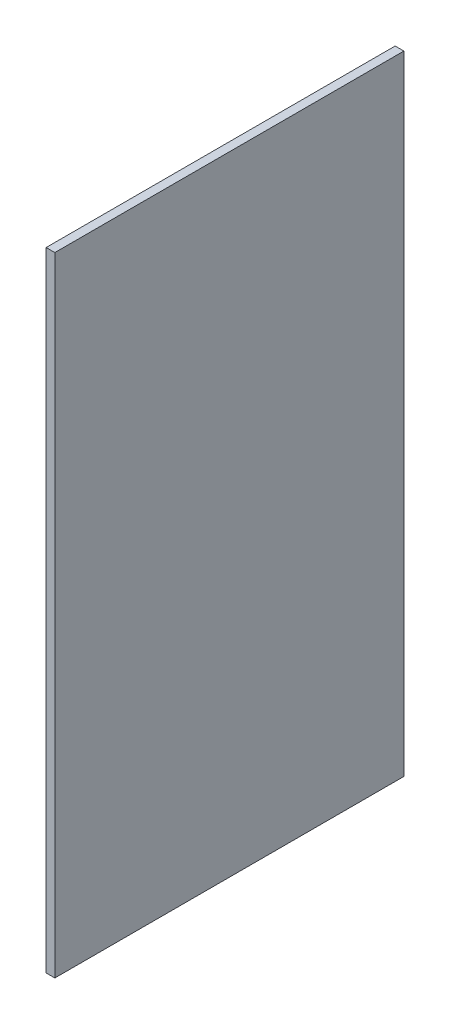
ISO-10303-21;
HEADER;
FILE_DESCRIPTION(('STEP AP214'),'2;1');
FILE_NAME('part.step','',(''),(''),'','','');
FILE_SCHEMA(('AUTOMOTIVE_DESIGN { 1 0 10303 214 1 1 1 1 }'));
ENDSEC;
DATA;
#1=APPLICATION_CONTEXT('core data for automotive mechanical design processes');
#2=APPLICATION_PROTOCOL_DEFINITION('international standard','automotive_design',2000,#1);
#3=PRODUCT_CONTEXT('',#1,'mechanical');
#4=PRODUCT('Part','Part','',(#3));
#5=PRODUCT_RELATED_PRODUCT_CATEGORY('part','',(#4));
#6=PRODUCT_DEFINITION_FORMATION('','',#4);
#7=PRODUCT_DEFINITION_CONTEXT('part definition',#1,'design');
#8=PRODUCT_DEFINITION('design','',#6,#7);
#9=PRODUCT_DEFINITION_SHAPE('','',#8);
#10=(LENGTH_UNIT() NAMED_UNIT(*) SI_UNIT(.MILLI.,.METRE.));
#11=(NAMED_UNIT(*) PLANE_ANGLE_UNIT() SI_UNIT($,.RADIAN.));
#12=(NAMED_UNIT(*) SI_UNIT($,.STERADIAN.) SOLID_ANGLE_UNIT());
#13=UNCERTAINTY_MEASURE_WITH_UNIT(LENGTH_MEASURE(1.E-05),#10,'distance_accuracy_value','');
#14=(GEOMETRIC_REPRESENTATION_CONTEXT(3) GLOBAL_UNCERTAINTY_ASSIGNED_CONTEXT((#13)) GLOBAL_UNIT_ASSIGNED_CONTEXT((#10,
#11,#12)) REPRESENTATION_CONTEXT('',''));
#15=CARTESIAN_POINT('',(0.,0.,0.));
#16=DIRECTION('',(0.,0.,1.));
#17=DIRECTION('',(1.,0.,0.));
#18=AXIS2_PLACEMENT_3D('',#15,#16,#17);
#19=CARTESIAN_POINT('',(10.,360.,200.));
#20=DIRECTION('',(0.,-1.,0.));
#21=DIRECTION('',(0.,0.,-1.));
#22=AXIS2_PLACEMENT_3D('',#19,#20,#21);
#23=PLANE('',#22);
#24=DIRECTION('',(0.,0.,1.));
#25=VECTOR('',#24,1.);
#26=CARTESIAN_POINT('',(0.,360.,200.));
#27=LINE('',#26,#25);
#28=CARTESIAN_POINT('',(0.,360.,-200.));
#29=VERTEX_POINT('',#28);
#30=CARTESIAN_POINT('',(0.,360.,200.));
#31=VERTEX_POINT('',#30);
#32=EDGE_CURVE('E113',#29,#31,#27,.T.);
#33=ORIENTED_EDGE('',*,*,#32,.T.);
#34=DIRECTION('',(-1.,0.,0.));
#35=VECTOR('',#34,1.);
#36=CARTESIAN_POINT('',(10.,360.,200.));
#37=LINE('',#36,#35);
#38=CARTESIAN_POINT('',(10.,360.,200.));
#39=VERTEX_POINT('',#38);
#40=EDGE_CURVE('E11',#39,#31,#37,.T.);
#41=ORIENTED_EDGE('',*,*,#40,.F.);
#42=DIRECTION('',(0.,0.,1.));
#43=VECTOR('',#42,1.);
#44=CARTESIAN_POINT('',(10.,360.,200.));
#45=LINE('',#44,#43);
#46=CARTESIAN_POINT('',(10.,360.,-200.));
#47=VERTEX_POINT('',#46);
#48=EDGE_CURVE('E97',#47,#39,#45,.T.);
#49=ORIENTED_EDGE('',*,*,#48,.F.);
#50=DIRECTION('',(-1.,0.,0.));
#51=VECTOR('',#50,1.);
#52=CARTESIAN_POINT('',(10.,360.,-200.));
#53=LINE('',#52,#51);
#54=EDGE_CURVE('E109',#47,#29,#53,.T.);
#55=ORIENTED_EDGE('',*,*,#54,.T.);
#56=EDGE_LOOP('',(#33,#41,#49,#55));
#57=FACE_BOUND('',#56,.T.);
#58=ADVANCED_FACE('F45',(#57),#23,.F.);
#59=CARTESIAN_POINT('',(10.,-360.,200.));
#60=DIRECTION('',(0.,0.,-1.));
#61=DIRECTION('',(0.,1.,0.));
#62=AXIS2_PLACEMENT_3D('',#59,#60,#61);
#63=PLANE('',#62);
#64=DIRECTION('',(0.,-1.,0.));
#65=VECTOR('',#64,1.);
#66=CARTESIAN_POINT('',(0.,-360.,200.));
#67=LINE('',#66,#65);
#68=CARTESIAN_POINT('',(0.,-360.,200.));
#69=VERTEX_POINT('',#68);
#70=EDGE_CURVE('E102',#31,#69,#67,.T.);
#71=ORIENTED_EDGE('',*,*,#70,.T.);
#72=DIRECTION('',(-1.,0.,0.));
#73=VECTOR('',#72,1.);
#74=CARTESIAN_POINT('',(10.,-360.,200.));
#75=LINE('',#74,#73);
#76=CARTESIAN_POINT('',(10.,-360.,200.));
#77=VERTEX_POINT('',#76);
#78=EDGE_CURVE('E54',#77,#69,#75,.T.);
#79=ORIENTED_EDGE('',*,*,#78,.F.);
#80=DIRECTION('',(0.,-1.,0.));
#81=VECTOR('',#80,1.);
#82=CARTESIAN_POINT('',(10.,-360.,200.));
#83=LINE('',#82,#81);
#84=EDGE_CURVE('E92',#39,#77,#83,.T.);
#85=ORIENTED_EDGE('',*,*,#84,.F.);
#86=ORIENTED_EDGE('',*,*,#40,.T.);
#87=EDGE_LOOP('',(#71,#79,#85,#86));
#88=FACE_BOUND('',#87,.T.);
#89=ADVANCED_FACE('F101',(#88),#63,.F.);
#90=CARTESIAN_POINT('',(10.,-360.,200.));
#91=DIRECTION('',(0.,1.,0.));
#92=DIRECTION('',(0.,0.,1.));
#93=AXIS2_PLACEMENT_3D('',#90,#91,#92);
#94=PLANE('',#93);
#95=DIRECTION('',(0.,0.,-1.));
#96=VECTOR('',#95,1.);
#97=CARTESIAN_POINT('',(0.,-360.,200.));
#98=LINE('',#97,#96);
#99=CARTESIAN_POINT('',(0.,-360.,-200.));
#100=VERTEX_POINT('',#99);
#101=EDGE_CURVE('E79',#69,#100,#98,.T.);
#102=ORIENTED_EDGE('',*,*,#101,.T.);
#103=DIRECTION('',(-1.,0.,0.));
#104=VECTOR('',#103,1.);
#105=CARTESIAN_POINT('',(10.,-360.,-200.));
#106=LINE('',#105,#104);
#107=CARTESIAN_POINT('',(10.,-360.,-200.));
#108=VERTEX_POINT('',#107);
#109=EDGE_CURVE('E104',#108,#100,#106,.T.);
#110=ORIENTED_EDGE('',*,*,#109,.F.);
#111=DIRECTION('',(0.,0.,-1.));
#112=VECTOR('',#111,1.);
#113=CARTESIAN_POINT('',(10.,-360.,200.));
#114=LINE('',#113,#112);
#115=EDGE_CURVE('E95',#77,#108,#114,.T.);
#116=ORIENTED_EDGE('',*,*,#115,.F.);
#117=ORIENTED_EDGE('',*,*,#78,.T.);
#118=EDGE_LOOP('',(#102,#110,#116,#117));
#119=FACE_BOUND('',#118,.T.);
#120=ADVANCED_FACE('F105',(#119),#94,.F.);
#121=CARTESIAN_POINT('',(10.,-360.,-200.));
#122=DIRECTION('',(0.,0.,1.));
#123=DIRECTION('',(0.,-1.,0.));
#124=AXIS2_PLACEMENT_3D('',#121,#122,#123);
#125=PLANE('',#124);
#126=DIRECTION('',(0.,1.,0.));
#127=VECTOR('',#126,1.);
#128=CARTESIAN_POINT('',(0.,-360.,-200.));
#129=LINE('',#128,#127);
#130=EDGE_CURVE('E85',#100,#29,#129,.T.);
#131=ORIENTED_EDGE('',*,*,#130,.T.);
#132=ORIENTED_EDGE('',*,*,#54,.F.);
#133=DIRECTION('',(0.,1.,0.));
#134=VECTOR('',#133,1.);
#135=CARTESIAN_POINT('',(10.,-360.,-200.));
#136=LINE('',#135,#134);
#137=EDGE_CURVE('E62',#108,#47,#136,.T.);
#138=ORIENTED_EDGE('',*,*,#137,.F.);
#139=ORIENTED_EDGE('',*,*,#109,.T.);
#140=EDGE_LOOP('',(#131,#132,#138,#139));
#141=FACE_BOUND('',#140,.T.);
#142=ADVANCED_FACE('F126',(#141),#125,.F.);
#143=CARTESIAN_POINT('',(10.,0.,0.));
#144=DIRECTION('',(1.,0.,0.));
#145=DIRECTION('',(0.,0.,-1.));
#146=AXIS2_PLACEMENT_3D('',#143,#144,#145);
#147=PLANE('',#146);
#148=ORIENTED_EDGE('',*,*,#48,.T.);
#149=ORIENTED_EDGE('',*,*,#84,.T.);
#150=ORIENTED_EDGE('',*,*,#115,.T.);
#151=ORIENTED_EDGE('',*,*,#137,.T.);
#152=EDGE_LOOP('',(#148,#149,#150,#151));
#153=FACE_BOUND('',#152,.T.);
#154=ADVANCED_FACE('F93',(#153),#147,.T.);
#155=CARTESIAN_POINT('',(0.,0.,0.));
#156=DIRECTION('',(1.,0.,0.));
#157=DIRECTION('',(0.,0.,-1.));
#158=AXIS2_PLACEMENT_3D('',#155,#156,#157);
#159=PLANE('',#158);
#160=ORIENTED_EDGE('',*,*,#32,.F.);
#161=ORIENTED_EDGE('',*,*,#130,.F.);
#162=ORIENTED_EDGE('',*,*,#101,.F.);
#163=ORIENTED_EDGE('',*,*,#70,.F.);
#164=EDGE_LOOP('',(#160,#161,#162,#163));
#165=FACE_BOUND('',#164,.T.);
#166=ADVANCED_FACE('F129',(#165),#159,.F.);
#167=CLOSED_SHELL('',(#58,#89,#120,#142,#154,#166));
#168=MANIFOLD_SOLID_BREP('B2',#167);
#169=ADVANCED_BREP_SHAPE_REPRESENTATION('',(#18,#168),#14);
#170=SHAPE_DEFINITION_REPRESENTATION(#9,#169);
ENDSEC;
END-ISO-10303-21;
